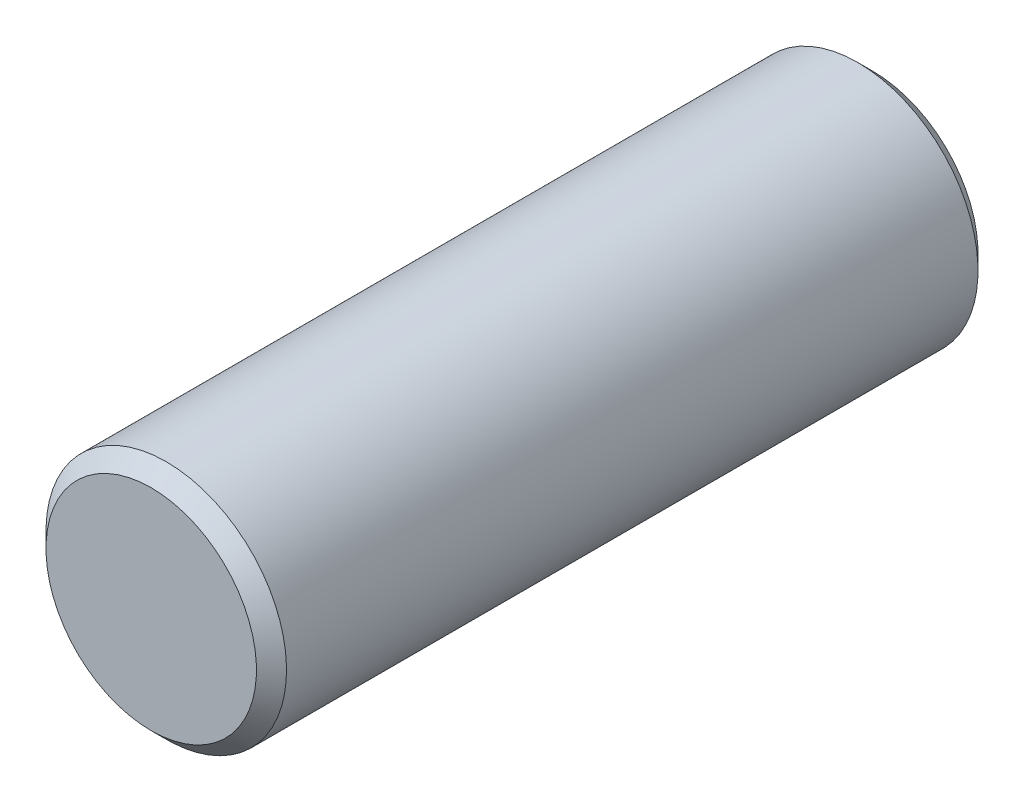
ISO-10303-21;
HEADER;
FILE_DESCRIPTION(('STEP AP214'),'2;1');
FILE_NAME('part.step','',(''),(''),'','','');
FILE_SCHEMA(('AUTOMOTIVE_DESIGN { 1 0 10303 214 1 1 1 1 }'));
ENDSEC;
DATA;
#1=APPLICATION_CONTEXT('core data for automotive mechanical design processes');
#2=APPLICATION_PROTOCOL_DEFINITION('international standard','automotive_design',2000,#1);
#3=PRODUCT_CONTEXT('',#1,'mechanical');
#4=PRODUCT('Part','Part','',(#3));
#5=PRODUCT_RELATED_PRODUCT_CATEGORY('part','',(#4));
#6=PRODUCT_DEFINITION_FORMATION('','',#4);
#7=PRODUCT_DEFINITION_CONTEXT('part definition',#1,'design');
#8=PRODUCT_DEFINITION('design','',#6,#7);
#9=PRODUCT_DEFINITION_SHAPE('','',#8);
#10=(LENGTH_UNIT() NAMED_UNIT(*) SI_UNIT(.MILLI.,.METRE.));
#11=(NAMED_UNIT(*) PLANE_ANGLE_UNIT() SI_UNIT($,.RADIAN.));
#12=(NAMED_UNIT(*) SI_UNIT($,.STERADIAN.) SOLID_ANGLE_UNIT());
#13=UNCERTAINTY_MEASURE_WITH_UNIT(LENGTH_MEASURE(1.E-05),#10,'distance_accuracy_value','');
#14=(GEOMETRIC_REPRESENTATION_CONTEXT(3) GLOBAL_UNCERTAINTY_ASSIGNED_CONTEXT((#13)) GLOBAL_UNIT_ASSIGNED_CONTEXT((#10,
#11,#12)) REPRESENTATION_CONTEXT('',''));
#15=CARTESIAN_POINT('',(0.,0.,0.));
#16=DIRECTION('',(0.,0.,1.));
#17=DIRECTION('',(1.,0.,0.));
#18=AXIS2_PLACEMENT_3D('',#15,#16,#17);
#19=CARTESIAN_POINT('',(0.,0.,6.));
#20=DIRECTION('',(0.,0.,1.));
#21=DIRECTION('',(0.,-1.,0.));
#22=AXIS2_PLACEMENT_3D('',#19,#20,#21);
#23=PLANE('',#22);
#24=CARTESIAN_POINT('',(0.,0.,5.99999999997181));
#25=DIRECTION('',(0.,0.,-1.));
#26=DIRECTION('',(0.,1.,0.));
#27=AXIS2_PLACEMENT_3D('',#24,#25,#26);
#28=CIRCLE('',#27,1.75000000001546);
#29=CARTESIAN_POINT('',(0.,1.75000000001546,5.99999999997181));
#30=VERTEX_POINT('',#29);
#31=EDGE_CURVE('E18',#30,#30,#28,.T.);
#32=ORIENTED_EDGE('',*,*,#31,.F.);
#33=EDGE_LOOP('',(#32));
#34=FACE_BOUND('',#33,.T.);
#35=ADVANCED_FACE('F15',(#34),#23,.T.);
#36=CARTESIAN_POINT('',(0.,0.,-6.));
#37=DIRECTION('',(0.,0.,1.));
#38=DIRECTION('',(0.,-1.,0.));
#39=AXIS2_PLACEMENT_3D('',#36,#37,#38);
#40=PLANE('',#39);
#41=CARTESIAN_POINT('',(0.,0.,-5.99999999991496));
#42=DIRECTION('',(0.,0.,1.));
#43=DIRECTION('',(0.,-1.,0.));
#44=AXIS2_PLACEMENT_3D('',#41,#42,#43);
#45=CIRCLE('',#44,1.75000000001546);
#46=CARTESIAN_POINT('',(0.,-1.75000000001546,-5.99999999991496));
#47=VERTEX_POINT('',#46);
#48=EDGE_CURVE('E27',#47,#47,#45,.T.);
#49=ORIENTED_EDGE('',*,*,#48,.F.);
#50=EDGE_LOOP('',(#49));
#51=FACE_BOUND('',#50,.T.);
#52=ADVANCED_FACE('F38',(#51),#40,.F.);
#53=CARTESIAN_POINT('',(0.,0.,5.74999999997772));
#54=DIRECTION('',(0.,0.,-1.));
#55=DIRECTION('',(0.,1.,0.));
#56=AXIS2_PLACEMENT_3D('',#53,#54,#55);
#57=CONICAL_SURFACE('',#56,2.00000000000955,0.785398163397448);
#58=CARTESIAN_POINT('',(0.,0.,5.75));
#59=DIRECTION('',(0.,0.,-1.));
#60=DIRECTION('',(0.,1.,0.));
#61=AXIS2_PLACEMENT_3D('',#58,#59,#60);
#62=CIRCLE('',#61,2.);
#63=CARTESIAN_POINT('',(0.,2.,5.75));
#64=VERTEX_POINT('',#63);
#65=EDGE_CURVE('E22',#64,#64,#62,.T.);
#66=ORIENTED_EDGE('',*,*,#65,.F.);
#67=EDGE_LOOP('',(#66));
#68=FACE_BOUND('',#67,.T.);
#69=ORIENTED_EDGE('',*,*,#31,.T.);
#70=EDGE_LOOP('',(#69));
#71=FACE_BOUND('',#70,.T.);
#72=ADVANCED_FACE('F35',(#68,#71),#57,.T.);
#73=CARTESIAN_POINT('',(0.,0.,-5.75000000003456));
#74=DIRECTION('',(0.,0.,1.));
#75=DIRECTION('',(0.,-1.,0.));
#76=AXIS2_PLACEMENT_3D('',#73,#74,#75);
#77=CONICAL_SURFACE('',#76,1.99999999995271,0.785398163511135);
#78=CARTESIAN_POINT('',(0.,0.,-5.75));
#79=DIRECTION('',(0.,0.,-1.));
#80=DIRECTION('',(0.,1.,0.));
#81=AXIS2_PLACEMENT_3D('',#78,#79,#80);
#82=CIRCLE('',#81,2.);
#83=CARTESIAN_POINT('',(0.,2.,-5.75));
#84=VERTEX_POINT('',#83);
#85=EDGE_CURVE('E10',#84,#84,#82,.F.);
#86=ORIENTED_EDGE('',*,*,#85,.F.);
#87=EDGE_LOOP('',(#86));
#88=FACE_BOUND('',#87,.T.);
#89=ORIENTED_EDGE('',*,*,#48,.T.);
#90=EDGE_LOOP('',(#89));
#91=FACE_BOUND('',#90,.T.);
#92=ADVANCED_FACE('F46',(#88,#91),#77,.T.);
#93=CARTESIAN_POINT('',(0.,0.,6.));
#94=DIRECTION('',(0.,0.,-1.));
#95=DIRECTION('',(0.,1.,0.));
#96=AXIS2_PLACEMENT_3D('',#93,#94,#95);
#97=CYLINDRICAL_SURFACE('',#96,2.);
#98=ORIENTED_EDGE('',*,*,#85,.T.);
#99=EDGE_LOOP('',(#98));
#100=FACE_BOUND('',#99,.T.);
#101=ORIENTED_EDGE('',*,*,#65,.T.);
#102=EDGE_LOOP('',(#101));
#103=FACE_BOUND('',#102,.T.);
#104=ADVANCED_FACE('F44',(#100,#103),#97,.T.);
#105=CLOSED_SHELL('',(#35,#52,#72,#92,#104));
#106=MANIFOLD_SOLID_BREP('B1',#105);
#107=ADVANCED_BREP_SHAPE_REPRESENTATION('',(#18,#106),#14);
#108=SHAPE_DEFINITION_REPRESENTATION(#9,#107);
ENDSEC;
END-ISO-10303-21;
